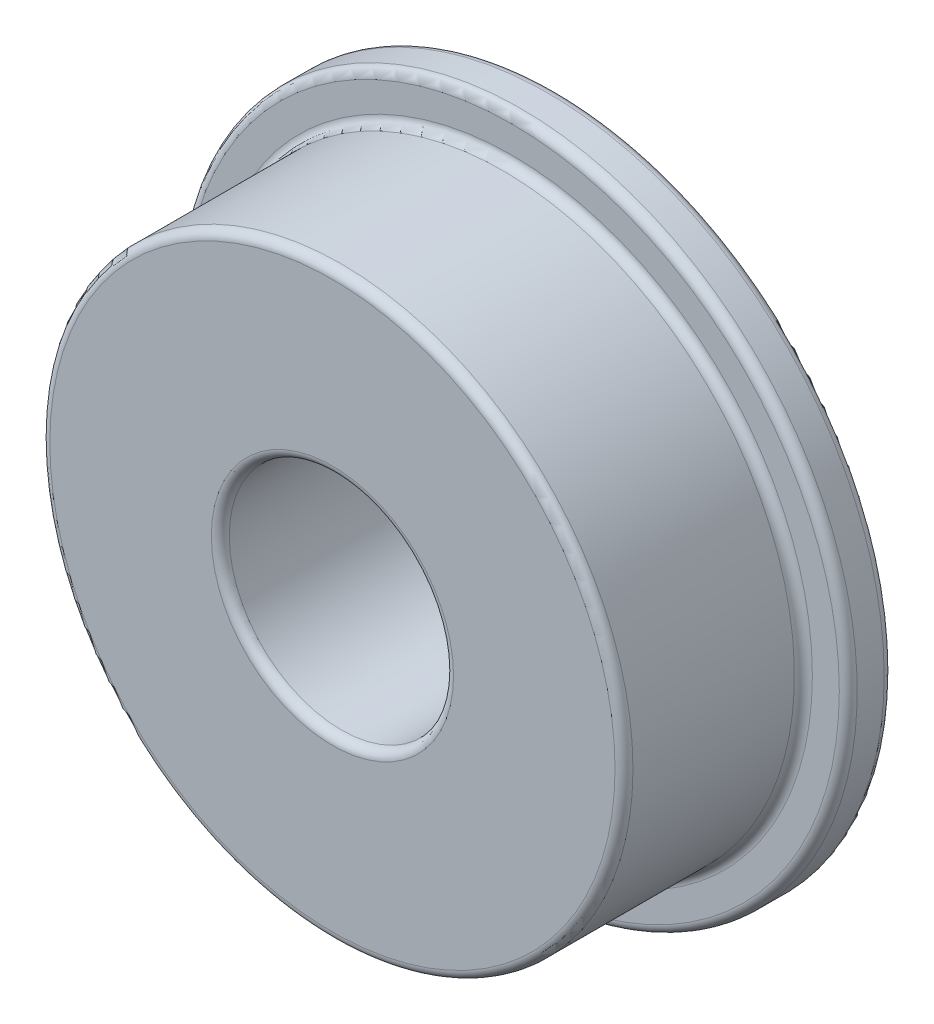
ISO-10303-21;
HEADER;
FILE_DESCRIPTION(('STEP AP214'),'2;1');
FILE_NAME('part.step','',(''),(''),'','','');
FILE_SCHEMA(('AUTOMOTIVE_DESIGN { 1 0 10303 214 1 1 1 1 }'));
ENDSEC;
DATA;
#1=APPLICATION_CONTEXT('core data for automotive mechanical design processes');
#2=APPLICATION_PROTOCOL_DEFINITION('international standard','automotive_design',2000,#1);
#3=PRODUCT_CONTEXT('',#1,'mechanical');
#4=PRODUCT('Part','Part','',(#3));
#5=PRODUCT_RELATED_PRODUCT_CATEGORY('part','',(#4));
#6=PRODUCT_DEFINITION_FORMATION('','',#4);
#7=PRODUCT_DEFINITION_CONTEXT('part definition',#1,'design');
#8=PRODUCT_DEFINITION('design','',#6,#7);
#9=PRODUCT_DEFINITION_SHAPE('','',#8);
#10=(LENGTH_UNIT() NAMED_UNIT(*) SI_UNIT(.MILLI.,.METRE.));
#11=(NAMED_UNIT(*) PLANE_ANGLE_UNIT() SI_UNIT($,.RADIAN.));
#12=(NAMED_UNIT(*) SI_UNIT($,.STERADIAN.) SOLID_ANGLE_UNIT());
#13=UNCERTAINTY_MEASURE_WITH_UNIT(LENGTH_MEASURE(1.E-05),#10,'distance_accuracy_value','');
#14=(GEOMETRIC_REPRESENTATION_CONTEXT(3) GLOBAL_UNCERTAINTY_ASSIGNED_CONTEXT((#13)) GLOBAL_UNIT_ASSIGNED_CONTEXT((#10,
#11,#12)) REPRESENTATION_CONTEXT('',''));
#15=CARTESIAN_POINT('',(0.,0.,0.));
#16=DIRECTION('',(0.,0.,1.));
#17=DIRECTION('',(1.,0.,0.));
#18=AXIS2_PLACEMENT_3D('',#15,#16,#17);
#19=CARTESIAN_POINT('',(0.,0.,5.));
#20=DIRECTION('',(0.,0.,-1.));
#21=DIRECTION('',(-1.,0.,0.));
#22=AXIS2_PLACEMENT_3D('',#19,#20,#21);
#23=CYLINDRICAL_SURFACE('',#22,6.5);
#24=CARTESIAN_POINT('',(0.,0.,1.2));
#25=DIRECTION('',(0.,0.,-1.));
#26=DIRECTION('',(-1.,0.,0.));
#27=AXIS2_PLACEMENT_3D('',#24,#25,#26);
#28=CIRCLE('',#27,6.5);
#29=CARTESIAN_POINT('',(-6.5,0.,1.2));
#30=VERTEX_POINT('',#29);
#31=EDGE_CURVE('E66',#30,#30,#28,.F.);
#32=ORIENTED_EDGE('',*,*,#31,.T.);
#33=EDGE_LOOP('',(#32));
#34=FACE_BOUND('',#33,.T.);
#35=CARTESIAN_POINT('',(0.,0.,4.8));
#36=DIRECTION('',(0.,0.,1.));
#37=DIRECTION('',(1.,0.,0.));
#38=AXIS2_PLACEMENT_3D('',#35,#36,#37);
#39=CIRCLE('',#38,6.5);
#40=CARTESIAN_POINT('',(6.5,0.,4.8));
#41=VERTEX_POINT('',#40);
#42=EDGE_CURVE('E69',#41,#41,#39,.F.);
#43=ORIENTED_EDGE('',*,*,#42,.T.);
#44=EDGE_LOOP('',(#43));
#45=FACE_BOUND('',#44,.T.);
#46=ADVANCED_FACE('F34',(#34,#45),#23,.T.);
#47=CARTESIAN_POINT('',(0.,0.,5.));
#48=DIRECTION('',(0.,0.,1.));
#49=DIRECTION('',(1.,0.,0.));
#50=AXIS2_PLACEMENT_3D('',#47,#48,#49);
#51=PLANE('',#50);
#52=CARTESIAN_POINT('',(0.,0.,5.));
#53=DIRECTION('',(0.,0.,1.));
#54=DIRECTION('',(1.,0.,0.));
#55=AXIS2_PLACEMENT_3D('',#52,#53,#54);
#56=CIRCLE('',#55,6.3);
#57=CARTESIAN_POINT('',(6.3,0.,5.));
#58=VERTEX_POINT('',#57);
#59=EDGE_CURVE('E60',#58,#58,#56,.T.);
#60=ORIENTED_EDGE('',*,*,#59,.T.);
#61=EDGE_LOOP('',(#60));
#62=FACE_BOUND('',#61,.T.);
#63=CARTESIAN_POINT('',(0.,0.,5.));
#64=DIRECTION('',(0.,0.,1.));
#65=DIRECTION('',(1.,0.,0.));
#66=AXIS2_PLACEMENT_3D('',#63,#64,#65);
#67=CIRCLE('',#66,2.7);
#68=CARTESIAN_POINT('',(2.7,0.,5.));
#69=VERTEX_POINT('',#68);
#70=EDGE_CURVE('E63',#69,#69,#67,.F.);
#71=ORIENTED_EDGE('',*,*,#70,.T.);
#72=EDGE_LOOP('',(#71));
#73=FACE_BOUND('',#72,.T.);
#74=ADVANCED_FACE('F94',(#62,#73),#51,.T.);
#75=CARTESIAN_POINT('',(0.,0.,0.));
#76=DIRECTION('',(0.,0.,1.));
#77=DIRECTION('',(1.,0.,0.));
#78=AXIS2_PLACEMENT_3D('',#75,#76,#77);
#79=PLANE('',#78);
#80=CARTESIAN_POINT('',(0.,0.,0.));
#81=DIRECTION('',(0.,0.,1.));
#82=DIRECTION('',(1.,0.,0.));
#83=AXIS2_PLACEMENT_3D('',#80,#81,#82);
#84=CIRCLE('',#83,2.7);
#85=CARTESIAN_POINT('',(2.7,0.,0.));
#86=VERTEX_POINT('',#85);
#87=EDGE_CURVE('E45',#86,#86,#84,.T.);
#88=ORIENTED_EDGE('',*,*,#87,.T.);
#89=EDGE_LOOP('',(#88));
#90=FACE_BOUND('',#89,.T.);
#91=CARTESIAN_POINT('',(0.,0.,0.));
#92=DIRECTION('',(0.,0.,1.));
#93=DIRECTION('',(1.,0.,0.));
#94=AXIS2_PLACEMENT_3D('',#91,#92,#93);
#95=CIRCLE('',#94,7.3);
#96=CARTESIAN_POINT('',(7.3,0.,0.));
#97=VERTEX_POINT('',#96);
#98=EDGE_CURVE('E49',#97,#97,#95,.F.);
#99=ORIENTED_EDGE('',*,*,#98,.T.);
#100=EDGE_LOOP('',(#99));
#101=FACE_BOUND('',#100,.T.);
#102=ADVANCED_FACE('F100',(#90,#101),#79,.F.);
#103=CARTESIAN_POINT('',(0.,0.,5.));
#104=DIRECTION('',(0.,0.,-1.));
#105=DIRECTION('',(-1.,0.,0.));
#106=AXIS2_PLACEMENT_3D('',#103,#104,#105);
#107=CYLINDRICAL_SURFACE('',#106,2.5);
#108=CARTESIAN_POINT('',(0.,0.,4.8));
#109=DIRECTION('',(0.,0.,1.));
#110=DIRECTION('',(1.,0.,0.));
#111=AXIS2_PLACEMENT_3D('',#108,#109,#110);
#112=CIRCLE('',#111,2.5);
#113=CARTESIAN_POINT('',(2.5,0.,4.8));
#114=VERTEX_POINT('',#113);
#115=EDGE_CURVE('E54',#114,#114,#112,.T.);
#116=ORIENTED_EDGE('',*,*,#115,.T.);
#117=EDGE_LOOP('',(#116));
#118=FACE_BOUND('',#117,.T.);
#119=CARTESIAN_POINT('',(0.,0.,0.2));
#120=DIRECTION('',(0.,0.,1.));
#121=DIRECTION('',(1.,0.,0.));
#122=AXIS2_PLACEMENT_3D('',#119,#120,#121);
#123=CIRCLE('',#122,2.5);
#124=CARTESIAN_POINT('',(2.5,0.,0.2));
#125=VERTEX_POINT('',#124);
#126=EDGE_CURVE('E57',#125,#125,#123,.F.);
#127=ORIENTED_EDGE('',*,*,#126,.T.);
#128=EDGE_LOOP('',(#127));
#129=FACE_BOUND('',#128,.T.);
#130=ADVANCED_FACE('F123',(#118,#129),#107,.F.);
#131=CARTESIAN_POINT('',(0.,0.,1.));
#132=DIRECTION('',(0.,0.,-1.));
#133=DIRECTION('',(-1.,0.,0.));
#134=AXIS2_PLACEMENT_3D('',#131,#132,#133);
#135=PLANE('',#134);
#136=CARTESIAN_POINT('',(0.,0.,1.));
#137=DIRECTION('',(0.,0.,-1.));
#138=DIRECTION('',(-1.,0.,0.));
#139=AXIS2_PLACEMENT_3D('',#136,#137,#138);
#140=CIRCLE('',#139,6.7);
#141=CARTESIAN_POINT('',(-6.7,0.,1.));
#142=VERTEX_POINT('',#141);
#143=EDGE_CURVE('E72',#142,#142,#140,.T.);
#144=ORIENTED_EDGE('',*,*,#143,.T.);
#145=EDGE_LOOP('',(#144));
#146=FACE_BOUND('',#145,.T.);
#147=CARTESIAN_POINT('',(0.,0.,1.));
#148=DIRECTION('',(0.,0.,-1.));
#149=DIRECTION('',(-1.,0.,0.));
#150=AXIS2_PLACEMENT_3D('',#147,#148,#149);
#151=CIRCLE('',#150,7.3);
#152=CARTESIAN_POINT('',(-7.3,0.,1.));
#153=VERTEX_POINT('',#152);
#154=EDGE_CURVE('E75',#153,#153,#151,.F.);
#155=ORIENTED_EDGE('',*,*,#154,.T.);
#156=EDGE_LOOP('',(#155));
#157=FACE_BOUND('',#156,.T.);
#158=ADVANCED_FACE('F79',(#146,#157),#135,.F.);
#159=CARTESIAN_POINT('',(0.,0.,1.));
#160=DIRECTION('',(0.,0.,-1.));
#161=DIRECTION('',(-1.,0.,0.));
#162=AXIS2_PLACEMENT_3D('',#159,#160,#161);
#163=CYLINDRICAL_SURFACE('',#162,7.5);
#164=CARTESIAN_POINT('',(0.,0.,0.8));
#165=DIRECTION('',(0.,0.,-1.));
#166=DIRECTION('',(-1.,0.,0.));
#167=AXIS2_PLACEMENT_3D('',#164,#165,#166);
#168=CIRCLE('',#167,7.5);
#169=CARTESIAN_POINT('',(-7.5,0.,0.8));
#170=VERTEX_POINT('',#169);
#171=EDGE_CURVE('E10',#170,#170,#168,.T.);
#172=ORIENTED_EDGE('',*,*,#171,.T.);
#173=EDGE_LOOP('',(#172));
#174=FACE_BOUND('',#173,.T.);
#175=CARTESIAN_POINT('',(0.,0.,0.2));
#176=DIRECTION('',(0.,0.,1.));
#177=DIRECTION('',(1.,0.,0.));
#178=AXIS2_PLACEMENT_3D('',#175,#176,#177);
#179=CIRCLE('',#178,7.5);
#180=CARTESIAN_POINT('',(7.5,0.,0.2));
#181=VERTEX_POINT('',#180);
#182=EDGE_CURVE('E41',#181,#181,#179,.T.);
#183=ORIENTED_EDGE('',*,*,#182,.T.);
#184=EDGE_LOOP('',(#183));
#185=FACE_BOUND('',#184,.T.);
#186=ADVANCED_FACE('F110',(#174,#185),#163,.T.);
#187=CARTESIAN_POINT('',(0.,0.,1.2));
#188=DIRECTION('',(0.,0.,-1.));
#189=DIRECTION('',(-1.,0.,0.));
#190=AXIS2_PLACEMENT_3D('',#187,#188,#189);
#191=TOROIDAL_SURFACE('',#190,6.7,0.2);
#192=ORIENTED_EDGE('',*,*,#31,.F.);
#193=EDGE_LOOP('',(#192));
#194=FACE_BOUND('',#193,.T.);
#195=ORIENTED_EDGE('',*,*,#143,.F.);
#196=EDGE_LOOP('',(#195));
#197=FACE_BOUND('',#196,.T.);
#198=ADVANCED_FACE('F106',(#194,#197),#191,.F.);
#199=CARTESIAN_POINT('',(0.,0.,4.8));
#200=DIRECTION('',(0.,0.,1.));
#201=DIRECTION('',(1.,0.,0.));
#202=AXIS2_PLACEMENT_3D('',#199,#200,#201);
#203=TOROIDAL_SURFACE('',#202,6.3,0.2);
#204=ORIENTED_EDGE('',*,*,#42,.F.);
#205=EDGE_LOOP('',(#204));
#206=FACE_BOUND('',#205,.T.);
#207=ORIENTED_EDGE('',*,*,#59,.F.);
#208=EDGE_LOOP('',(#207));
#209=FACE_BOUND('',#208,.T.);
#210=ADVANCED_FACE('F109',(#206,#209),#203,.T.);
#211=CARTESIAN_POINT('',(0.,0.,4.8));
#212=DIRECTION('',(0.,0.,1.));
#213=DIRECTION('',(1.,0.,0.));
#214=AXIS2_PLACEMENT_3D('',#211,#212,#213);
#215=TOROIDAL_SURFACE('',#214,2.7,0.2);
#216=ORIENTED_EDGE('',*,*,#70,.F.);
#217=EDGE_LOOP('',(#216));
#218=FACE_BOUND('',#217,.T.);
#219=ORIENTED_EDGE('',*,*,#115,.F.);
#220=EDGE_LOOP('',(#219));
#221=FACE_BOUND('',#220,.T.);
#222=ADVANCED_FACE('F90',(#218,#221),#215,.T.);
#223=CARTESIAN_POINT('',(0.,0.,0.2));
#224=DIRECTION('',(0.,0.,1.));
#225=DIRECTION('',(1.,0.,0.));
#226=AXIS2_PLACEMENT_3D('',#223,#224,#225);
#227=TOROIDAL_SURFACE('',#226,2.7,0.2);
#228=ORIENTED_EDGE('',*,*,#126,.F.);
#229=EDGE_LOOP('',(#228));
#230=FACE_BOUND('',#229,.T.);
#231=ORIENTED_EDGE('',*,*,#87,.F.);
#232=EDGE_LOOP('',(#231));
#233=FACE_BOUND('',#232,.T.);
#234=ADVANCED_FACE('F84',(#230,#233),#227,.T.);
#235=CARTESIAN_POINT('',(0.,0.,0.8));
#236=DIRECTION('',(0.,0.,-1.));
#237=DIRECTION('',(-1.,0.,0.));
#238=AXIS2_PLACEMENT_3D('',#235,#236,#237);
#239=TOROIDAL_SURFACE('',#238,7.3,0.2);
#240=ORIENTED_EDGE('',*,*,#154,.F.);
#241=EDGE_LOOP('',(#240));
#242=FACE_BOUND('',#241,.T.);
#243=ORIENTED_EDGE('',*,*,#171,.F.);
#244=EDGE_LOOP('',(#243));
#245=FACE_BOUND('',#244,.T.);
#246=ADVANCED_FACE('F81',(#242,#245),#239,.T.);
#247=CARTESIAN_POINT('',(0.,0.,0.2));
#248=DIRECTION('',(0.,0.,1.));
#249=DIRECTION('',(1.,0.,0.));
#250=AXIS2_PLACEMENT_3D('',#247,#248,#249);
#251=TOROIDAL_SURFACE('',#250,7.3,0.2);
#252=ORIENTED_EDGE('',*,*,#182,.F.);
#253=EDGE_LOOP('',(#252));
#254=FACE_BOUND('',#253,.T.);
#255=ORIENTED_EDGE('',*,*,#98,.F.);
#256=EDGE_LOOP('',(#255));
#257=FACE_BOUND('',#256,.T.);
#258=ADVANCED_FACE('F36',(#254,#257),#251,.T.);
#259=CLOSED_SHELL('',(#46,#74,#102,#130,#158,#186,#198,#210,#222,#234,#246,#258));
#260=MANIFOLD_SOLID_BREP('B2',#259);
#261=ADVANCED_BREP_SHAPE_REPRESENTATION('',(#18,#260),#14);
#262=SHAPE_DEFINITION_REPRESENTATION(#9,#261);
ENDSEC;
END-ISO-10303-21;
